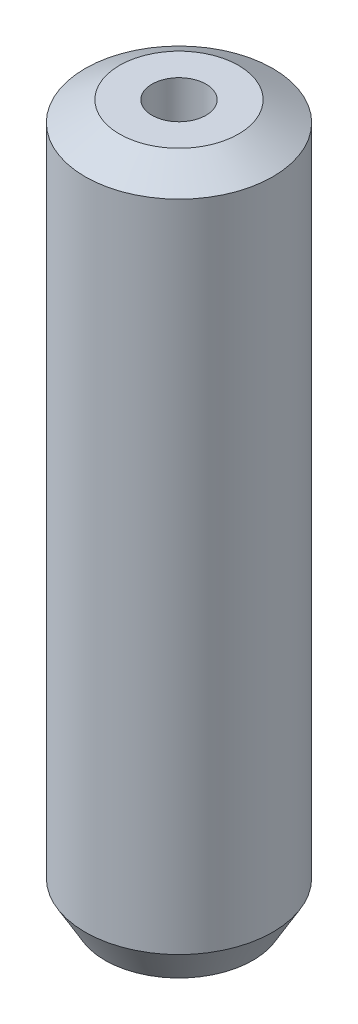
ISO-10303-21;
HEADER;
FILE_DESCRIPTION(('STEP AP214'),'2;1');
FILE_NAME('part.step','',(''),(''),'','','');
FILE_SCHEMA(('AUTOMOTIVE_DESIGN { 1 0 10303 214 1 1 1 1 }'));
ENDSEC;
DATA;
#1=APPLICATION_CONTEXT('core data for automotive mechanical design processes');
#2=APPLICATION_PROTOCOL_DEFINITION('international standard','automotive_design',2000,#1);
#3=PRODUCT_CONTEXT('',#1,'mechanical');
#4=PRODUCT('Part','Part','',(#3));
#5=PRODUCT_RELATED_PRODUCT_CATEGORY('part','',(#4));
#6=PRODUCT_DEFINITION_FORMATION('','',#4);
#7=PRODUCT_DEFINITION_CONTEXT('part definition',#1,'design');
#8=PRODUCT_DEFINITION('design','',#6,#7);
#9=PRODUCT_DEFINITION_SHAPE('','',#8);
#10=(LENGTH_UNIT() NAMED_UNIT(*) SI_UNIT(.MILLI.,.METRE.));
#11=(NAMED_UNIT(*) PLANE_ANGLE_UNIT() SI_UNIT($,.RADIAN.));
#12=(NAMED_UNIT(*) SI_UNIT($,.STERADIAN.) SOLID_ANGLE_UNIT());
#13=UNCERTAINTY_MEASURE_WITH_UNIT(LENGTH_MEASURE(1.E-05),#10,'distance_accuracy_value','');
#14=(GEOMETRIC_REPRESENTATION_CONTEXT(3) GLOBAL_UNCERTAINTY_ASSIGNED_CONTEXT((#13)) GLOBAL_UNIT_ASSIGNED_CONTEXT((#10,
#11,#12)) REPRESENTATION_CONTEXT('',''));
#15=CARTESIAN_POINT('',(0.,0.,0.));
#16=DIRECTION('',(0.,0.,1.));
#17=DIRECTION('',(1.,0.,0.));
#18=AXIS2_PLACEMENT_3D('',#15,#16,#17);
#19=CARTESIAN_POINT('',(0.,37.7509362785952,0.));
#20=DIRECTION('',(0.,-1.,0.));
#21=DIRECTION('',(0.,0.,-1.));
#22=AXIS2_PLACEMENT_3D('',#19,#20,#21);
#23=CYLINDRICAL_SURFACE('',#22,5.);
#24=CARTESIAN_POINT('',(0.,36.695215853087,0.));
#25=DIRECTION('',(0.,1.,0.));
#26=DIRECTION('',(0.,0.,1.));
#27=AXIS2_PLACEMENT_3D('',#24,#25,#26);
#28=CIRCLE('',#27,5.);
#29=CARTESIAN_POINT('',(0.,36.695215853087,-5.));
#30=VERTEX_POINT('',#29);
#31=EDGE_CURVE('E50',#30,#30,#28,.F.);
#32=CARTESIAN_POINT('',(0.,1.82856141556856,0.));
#33=DIRECTION('',(0.,1.,0.));
#34=DIRECTION('',(0.,0.,1.));
#35=AXIS2_PLACEMENT_3D('',#32,#33,#34);
#36=CIRCLE('',#35,5.);
#37=CARTESIAN_POINT('',(0.,1.82856141556856,-5.));
#38=VERTEX_POINT('',#37);
#39=EDGE_CURVE('E51',#38,#38,#36,.T.);
#40=CARTESIAN_POINT('',(0.,36.695215853087,-5.));
#41=CARTESIAN_POINT('',(0.,36.3320215360295,-5.));
#42=CARTESIAN_POINT('',(0.,35.968827218972,-5.));
#43=CARTESIAN_POINT('',(0.,35.2424385848571,-5.));
#44=CARTESIAN_POINT('',(0.,34.8792442677996,-5.));
#45=CARTESIAN_POINT('',(0.,34.1528556336846,-5.));
#46=CARTESIAN_POINT('',(0.,33.7896613166271,-5.));
#47=CARTESIAN_POINT('',(0.,33.0632726825122,-5.));
#48=CARTESIAN_POINT('',(0.,32.7000783654547,-5.));
#49=CARTESIAN_POINT('',(0.,31.9736897313397,-5.));
#50=CARTESIAN_POINT('',(0.,31.6104954142822,-5.));
#51=CARTESIAN_POINT('',(0.,30.8841067801673,-5.));
#52=CARTESIAN_POINT('',(0.,30.5209124631098,-5.));
#53=CARTESIAN_POINT('',(0.,29.7945238289948,-5.));
#54=CARTESIAN_POINT('',(0.,29.4313295119373,-5.));
#55=CARTESIAN_POINT('',(0.,28.7049408778224,-5.));
#56=CARTESIAN_POINT('',(0.,28.3417465607649,-5.));
#57=CARTESIAN_POINT('',(0.,27.6153579266499,-5.));
#58=CARTESIAN_POINT('',(0.,27.2521636095924,-5.));
#59=CARTESIAN_POINT('',(0.,26.5257749754775,-5.));
#60=CARTESIAN_POINT('',(0.,26.16258065842,-5.));
#61=CARTESIAN_POINT('',(0.,25.436192024305,-5.));
#62=CARTESIAN_POINT('',(0.,25.0729977072475,-5.));
#63=CARTESIAN_POINT('',(0.,24.3466090731326,-5.));
#64=CARTESIAN_POINT('',(0.,23.9834147560751,-5.));
#65=CARTESIAN_POINT('',(0.,23.2570261219601,-5.));
#66=CARTESIAN_POINT('',(0.,22.8938318049026,-5.));
#67=CARTESIAN_POINT('',(0.,22.1674431707877,-5.));
#68=CARTESIAN_POINT('',(0.,21.8042488537302,-5.));
#69=CARTESIAN_POINT('',(0.,21.0778602196152,-5.));
#70=CARTESIAN_POINT('',(0.,20.7146659025577,-5.));
#71=CARTESIAN_POINT('',(0.,19.9882772684428,-5.));
#72=CARTESIAN_POINT('',(0.,19.6250829513853,-5.));
#73=CARTESIAN_POINT('',(0.,18.8986943172703,-5.));
#74=CARTESIAN_POINT('',(0.,18.5355000002128,-5.));
#75=CARTESIAN_POINT('',(0.,17.8091113660978,-5.));
#76=CARTESIAN_POINT('',(0.,17.4459170490404,-5.));
#77=CARTESIAN_POINT('',(0.,16.7195284149254,-5.));
#78=CARTESIAN_POINT('',(0.,16.3563340978679,-5.));
#79=CARTESIAN_POINT('',(0.,15.6299454637529,-5.));
#80=CARTESIAN_POINT('',(0.,15.2667511466955,-5.));
#81=CARTESIAN_POINT('',(0.,14.5403625125805,-5.));
#82=CARTESIAN_POINT('',(0.,14.177168195523,-5.));
#83=CARTESIAN_POINT('',(0.,13.450779561408,-5.));
#84=CARTESIAN_POINT('',(0.,13.0875852443506,-5.));
#85=CARTESIAN_POINT('',(0.,12.3611966102356,-5.));
#86=CARTESIAN_POINT('',(0.,11.9980022931781,-5.));
#87=CARTESIAN_POINT('',(0.,11.2716136590631,-5.));
#88=CARTESIAN_POINT('',(0.,10.9084193420057,-5.));
#89=CARTESIAN_POINT('',(0.,10.1820307078907,-5.));
#90=CARTESIAN_POINT('',(0.,9.8188363908332,-5.));
#91=CARTESIAN_POINT('',(0.,9.09244775671823,-5.));
#92=CARTESIAN_POINT('',(0.,8.72925343966075,-5.));
#93=CARTESIAN_POINT('',(0.,8.00286480554578,-5.));
#94=CARTESIAN_POINT('',(0.,7.6396704884883,-5.));
#95=CARTESIAN_POINT('',(0.,6.91328185437333,-5.));
#96=CARTESIAN_POINT('',(0.,6.55008753731585,-5.));
#97=CARTESIAN_POINT('',(0.,5.82369890320088,-5.));
#98=CARTESIAN_POINT('',(0.,5.4605045861434,-5.));
#99=CARTESIAN_POINT('',(0.,4.73411595202843,-5.));
#100=CARTESIAN_POINT('',(0.,4.37092163497095,-5.));
#101=CARTESIAN_POINT('',(0.,3.64453300085598,-5.));
#102=CARTESIAN_POINT('',(0.,3.28133868379849,-5.));
#103=CARTESIAN_POINT('',(0.,2.55495004968353,-5.));
#104=CARTESIAN_POINT('',(0.,2.19175573262604,-5.));
#105=CARTESIAN_POINT('',(0.,1.82856141556856,-5.));
#106=B_SPLINE_CURVE_WITH_KNOTS('',3,(#40,#41,#42,#43,#44,#45,#46,#47,#48,#49,#50,#51,#52,#53,
#54,#55,#56,#57,#58,#59,#60,#61,#62,#63,#64,#65,#66,#67,#68,#69,#70,#71,#72,#73,#74,#75,#76,#77,
#78,#79,#80,#81,#82,#83,#84,#85,#86,#87,#88,#89,#90,#91,#92,#93,#94,#95,#96,#97,#98,#99,#100,
#101,#102,#103,#104,#105),.UNSPECIFIED.,.F.,.F.,(4,2,2,2,2,2,2,2,2,2,2,2,2,2,2,2,2,2,2,2,2,2,2,
2,2,2,2,2,2,2,2,2,4),(0.,1.08958295117245,2.1791659023449,3.26874885351735,4.3583318046898,
5.44791475586225,6.5374977070347,7.62708065820716,8.71666360937961,9.80624656055206,
10.8958295117245,11.985412462897,13.0749954140694,14.1645783652419,15.2541613164143,
16.3437442675868,17.4333272187592,18.5229101699317,19.6124931211041,20.7020760722766,
21.791659023449,22.8812419746215,23.9708249257939,25.0604078769664,26.1499908281388,
27.2395737793113,28.3291567304837,29.4187396816562,30.5083226328286,31.5979055840011,
32.6874885351735,33.777071486346,34.8666544375184),.UNSPECIFIED.);
#107=EDGE_CURVE('BSEAM39',#30,#38,#106,.T.);
#108=ORIENTED_EDGE('',*,*,#31,.T.);
#109=ORIENTED_EDGE('',*,*,#39,.T.);
#110=ORIENTED_EDGE('',*,*,#107,.T.);
#111=ORIENTED_EDGE('',*,*,#107,.F.);
#112=EDGE_LOOP('',(#108,#110,#109,#111));
#113=FACE_BOUND('',#112,.T.);
#114=ADVANCED_FACE('F39',(#113),#23,.T.);
#115=CARTESIAN_POINT('',(0.,37.7509362785952,0.));
#116=DIRECTION('',(0.,1.,0.));
#117=DIRECTION('',(0.,0.,1.));
#118=AXIS2_PLACEMENT_3D('',#115,#116,#117);
#119=PLANE('',#118);
#120=CARTESIAN_POINT('',(0.,37.7509362785952,0.));
#121=DIRECTION('',(0.,1.,0.));
#122=DIRECTION('',(0.,0.,1.));
#123=AXIS2_PLACEMENT_3D('',#120,#121,#122);
#124=CIRCLE('',#123,3.17143858443158);
#125=CARTESIAN_POINT('',(0.,37.7509362785952,3.17143858443158));
#126=VERTEX_POINT('',#125);
#127=EDGE_CURVE('E54',#126,#126,#124,.T.);
#128=ORIENTED_EDGE('',*,*,#127,.T.);
#129=EDGE_LOOP('',(#128));
#130=FACE_BOUND('',#129,.T.);
#131=CARTESIAN_POINT('',(0.,37.7509362785952,0.));
#132=DIRECTION('',(0.,1.,0.));
#133=DIRECTION('',(0.,0.,1.));
#134=AXIS2_PLACEMENT_3D('',#131,#132,#133);
#135=CIRCLE('',#134,1.44060113111071);
#136=CARTESIAN_POINT('',(0.,37.7509362785952,-1.44060113111071));
#137=VERTEX_POINT('',#136);
#138=EDGE_CURVE('E58',#137,#137,#135,.T.);
#139=ORIENTED_EDGE('',*,*,#138,.F.);
#140=EDGE_LOOP('',(#139));
#141=FACE_BOUND('',#140,.T.);
#142=ADVANCED_FACE('F69',(#130,#141),#119,.T.);
#143=CARTESIAN_POINT('',(0.,0.,0.));
#144=DIRECTION('',(0.,1.,0.));
#145=DIRECTION('',(0.,0.,1.));
#146=AXIS2_PLACEMENT_3D('',#143,#144,#145);
#147=PLANE('',#146);
#148=CARTESIAN_POINT('',(0.,0.,0.));
#149=DIRECTION('',(0.,1.,0.));
#150=DIRECTION('',(0.,0.,1.));
#151=AXIS2_PLACEMENT_3D('',#148,#149,#150);
#152=CIRCLE('',#151,3.94427957449173);
#153=CARTESIAN_POINT('',(0.,0.,3.94427957449173));
#154=VERTEX_POINT('',#153);
#155=EDGE_CURVE('E10',#154,#154,#152,.F.);
#156=ORIENTED_EDGE('',*,*,#155,.T.);
#157=EDGE_LOOP('',(#156));
#158=FACE_BOUND('',#157,.T.);
#159=CARTESIAN_POINT('',(0.,0.,0.));
#160=DIRECTION('',(0.,1.,0.));
#161=DIRECTION('',(0.,0.,1.));
#162=AXIS2_PLACEMENT_3D('',#159,#160,#161);
#163=CIRCLE('',#162,1.44060113111071);
#164=CARTESIAN_POINT('',(0.,0.,-1.44060113111071));
#165=VERTEX_POINT('',#164);
#166=EDGE_CURVE('E63',#165,#165,#163,.T.);
#167=ORIENTED_EDGE('',*,*,#166,.T.);
#168=EDGE_LOOP('',(#167));
#169=FACE_BOUND('',#168,.T.);
#170=ADVANCED_FACE('F75',(#158,#169),#147,.F.);
#171=CARTESIAN_POINT('',(0.,37.7509362785952,0.));
#172=DIRECTION('',(0.,-1.,0.));
#173=DIRECTION('',(0.,0.,-1.));
#174=AXIS2_PLACEMENT_3D('',#171,#172,#173);
#175=CYLINDRICAL_SURFACE('',#174,1.44060113111071);
#176=CARTESIAN_POINT('',(0.,37.7509362785952,-1.44060113111071));
#177=CARTESIAN_POINT('',(0.,37.3576973590265,-1.44060113111071));
#178=CARTESIAN_POINT('',(0.,36.9644584394578,-1.44060113111071));
#179=CARTESIAN_POINT('',(0.,36.1779806003204,-1.44060113111071));
#180=CARTESIAN_POINT('',(0.,35.7847416807517,-1.44060113111071));
#181=CARTESIAN_POINT('',(0.,34.9982638416143,-1.44060113111071));
#182=CARTESIAN_POINT('',(0.,34.6050249220456,-1.44060113111071));
#183=CARTESIAN_POINT('',(0.,33.8185470829082,-1.44060113111071));
#184=CARTESIAN_POINT('',(0.,33.4253081633395,-1.44060113111071));
#185=CARTESIAN_POINT('',(0.,32.6388303242021,-1.44060113111071));
#186=CARTESIAN_POINT('',(0.,32.2455914046334,-1.44060113111071));
#187=CARTESIAN_POINT('',(0.,31.459113565496,-1.44060113111071));
#188=CARTESIAN_POINT('',(0.,31.0658746459273,-1.44060113111071));
#189=CARTESIAN_POINT('',(0.,30.2793968067899,-1.44060113111071));
#190=CARTESIAN_POINT('',(0.,29.8861578872212,-1.44060113111071));
#191=CARTESIAN_POINT('',(0.,29.0996800480838,-1.44060113111071));
#192=CARTESIAN_POINT('',(0.,28.7064411285151,-1.44060113111071));
#193=CARTESIAN_POINT('',(0.,27.9199632893777,-1.44060113111071));
#194=CARTESIAN_POINT('',(0.,27.526724369809,-1.44060113111071));
#195=CARTESIAN_POINT('',(0.,26.7402465306716,-1.44060113111071));
#196=CARTESIAN_POINT('',(0.,26.3470076111029,-1.44060113111071));
#197=CARTESIAN_POINT('',(0.,25.5605297719655,-1.44060113111071));
#198=CARTESIAN_POINT('',(0.,25.1672908523968,-1.44060113111071));
#199=CARTESIAN_POINT('',(0.,24.3808130132594,-1.44060113111071));
#200=CARTESIAN_POINT('',(0.,23.9875740936907,-1.44060113111071));
#201=CARTESIAN_POINT('',(0.,23.2010962545533,-1.44060113111071));
#202=CARTESIAN_POINT('',(0.,22.8078573349846,-1.44060113111071));
#203=CARTESIAN_POINT('',(0.,22.0213794958472,-1.44060113111071));
#204=CARTESIAN_POINT('',(0.,21.6281405762785,-1.44060113111071));
#205=CARTESIAN_POINT('',(0.,20.8416627371411,-1.44060113111071));
#206=CARTESIAN_POINT('',(0.,20.4484238175724,-1.44060113111071));
#207=CARTESIAN_POINT('',(0.,19.661945978435,-1.44060113111071));
#208=CARTESIAN_POINT('',(0.,19.2687070588663,-1.44060113111071));
#209=CARTESIAN_POINT('',(0.,18.4822292197289,-1.44060113111071));
#210=CARTESIAN_POINT('',(0.,18.0889903001602,-1.44060113111071));
#211=CARTESIAN_POINT('',(0.,17.3025124610228,-1.44060113111071));
#212=CARTESIAN_POINT('',(0.,16.9092735414541,-1.44060113111071));
#213=CARTESIAN_POINT('',(0.,16.1227957023167,-1.44060113111071));
#214=CARTESIAN_POINT('',(0.,15.729556782748,-1.44060113111071));
#215=CARTESIAN_POINT('',(0.,14.9430789436106,-1.44060113111071));
#216=CARTESIAN_POINT('',(0.,14.5498400240419,-1.44060113111071));
#217=CARTESIAN_POINT('',(0.,13.7633621849045,-1.44060113111071));
#218=CARTESIAN_POINT('',(0.,13.3701232653358,-1.44060113111071));
#219=CARTESIAN_POINT('',(0.,12.5836454261984,-1.44060113111071));
#220=CARTESIAN_POINT('',(0.,12.1904065066297,-1.44060113111071));
#221=CARTESIAN_POINT('',(0.,11.4039286674923,-1.44060113111071));
#222=CARTESIAN_POINT('',(0.,11.0106897479236,-1.44060113111071));
#223=CARTESIAN_POINT('',(0.,10.2242119087862,-1.44060113111071));
#224=CARTESIAN_POINT('',(0.,9.8309729892175,-1.44060113111071));
#225=CARTESIAN_POINT('',(0.,9.0444951500801,-1.44060113111071));
#226=CARTESIAN_POINT('',(0.,8.6512562305114,-1.44060113111071));
#227=CARTESIAN_POINT('',(0.,7.86477839137399,-1.44060113111071));
#228=CARTESIAN_POINT('',(0.,7.4715394718053,-1.44060113111071));
#229=CARTESIAN_POINT('',(0.,6.6850616326679,-1.44060113111071));
#230=CARTESIAN_POINT('',(0.,6.2918227130992,-1.44060113111071));
#231=CARTESIAN_POINT('',(0.,5.5053448739618,-1.44060113111071));
#232=CARTESIAN_POINT('',(0.,5.1121059543931,-1.44060113111071));
#233=CARTESIAN_POINT('',(0.,4.3256281152557,-1.44060113111071));
#234=CARTESIAN_POINT('',(0.,3.932389195687,-1.44060113111071));
#235=CARTESIAN_POINT('',(0.,3.1459113565496,-1.44060113111071));
#236=CARTESIAN_POINT('',(0.,2.7526724369809,-1.44060113111071));
#237=CARTESIAN_POINT('',(0.,1.9661945978435,-1.44060113111071));
#238=CARTESIAN_POINT('',(0.,1.5729556782748,-1.44060113111071));
#239=CARTESIAN_POINT('',(0.,0.786477839137402,-1.44060113111071));
#240=CARTESIAN_POINT('',(0.,0.393238919568701,-1.44060113111071));
#241=CARTESIAN_POINT('',(0.,0.,-1.44060113111071));
#242=B_SPLINE_CURVE_WITH_KNOTS('',3,(#176,#177,#178,#179,#180,#181,#182,#183,#184,#185,#186,
#187,#188,#189,#190,#191,#192,#193,#194,#195,#196,#197,#198,#199,#200,#201,#202,#203,#204,#205,
#206,#207,#208,#209,#210,#211,#212,#213,#214,#215,#216,#217,#218,#219,#220,#221,#222,#223,#224,
#225,#226,#227,#228,#229,#230,#231,#232,#233,#234,#235,#236,#237,#238,#239,#240,#241),
.UNSPECIFIED.,.F.,.F.,(4,2,2,2,2,2,2,2,2,2,2,2,2,2,2,2,2,2,2,2,2,2,2,2,2,2,2,2,2,2,2,2,4),(0.,
1.1797167587061,2.3594335174122,3.53915027611831,4.7188670348244,5.8985837935305,
7.07830055223661,8.25801731094271,9.4377340696488,10.6174508283549,11.797167587061,
12.9768843457671,14.1566011044732,15.3363178631793,16.5160346218854,17.6957513805915,
18.8754681392976,20.0551848980037,21.2349016567098,22.4146184154159,23.594335174122,
24.7740519328281,25.9537686915342,27.1334854502403,28.3132022089464,29.4929189676525,
30.6726357263586,31.8523524850647,33.0320692437708,34.2117860024769,35.391502761183,
36.5712195198891,37.7509362785952),.UNSPECIFIED.);
#243=EDGE_CURVE('BSEAM70',#137,#165,#242,.T.);
#244=ORIENTED_EDGE('',*,*,#138,.T.);
#245=ORIENTED_EDGE('',*,*,#166,.F.);
#246=ORIENTED_EDGE('',*,*,#243,.T.);
#247=ORIENTED_EDGE('',*,*,#243,.F.);
#248=EDGE_LOOP('',(#244,#246,#245,#247));
#249=FACE_BOUND('',#248,.T.);
#250=ADVANCED_FACE('F70',(#249),#175,.F.);
#251=CARTESIAN_POINT('',(0.,37.7509362785952,0.));
#252=DIRECTION('',(0.,-1.,0.));
#253=DIRECTION('',(0.,0.,-1.));
#254=AXIS2_PLACEMENT_3D('',#251,#252,#253);
#255=CONICAL_SURFACE('',#254,3.17143858443158,1.04719755119659);
#256=ORIENTED_EDGE('',*,*,#31,.F.);
#257=EDGE_LOOP('',(#256));
#258=FACE_BOUND('',#257,.T.);
#259=ORIENTED_EDGE('',*,*,#127,.F.);
#260=EDGE_LOOP('',(#259));
#261=FACE_BOUND('',#260,.T.);
#262=ADVANCED_FACE('F81',(#258,#261),#255,.T.);
#263=CARTESIAN_POINT('',(0.,1.82856141556855,0.));
#264=DIRECTION('',(0.,1.,0.));
#265=DIRECTION('',(0.,0.,1.));
#266=AXIS2_PLACEMENT_3D('',#263,#264,#265);
#267=CONICAL_SURFACE('',#266,5.,0.523598775598302);
#268=ORIENTED_EDGE('',*,*,#155,.F.);
#269=EDGE_LOOP('',(#268));
#270=FACE_BOUND('',#269,.T.);
#271=ORIENTED_EDGE('',*,*,#39,.F.);
#272=EDGE_LOOP('',(#271));
#273=FACE_BOUND('',#272,.T.);
#274=ADVANCED_FACE('F45',(#270,#273),#267,.T.);
#275=CLOSED_SHELL('',(#114,#142,#170,#250,#262,#274));
#276=MANIFOLD_SOLID_BREP('B2',#275);
#277=ADVANCED_BREP_SHAPE_REPRESENTATION('',(#18,#276),#14);
#278=SHAPE_DEFINITION_REPRESENTATION(#9,#277);
ENDSEC;
END-ISO-10303-21;
